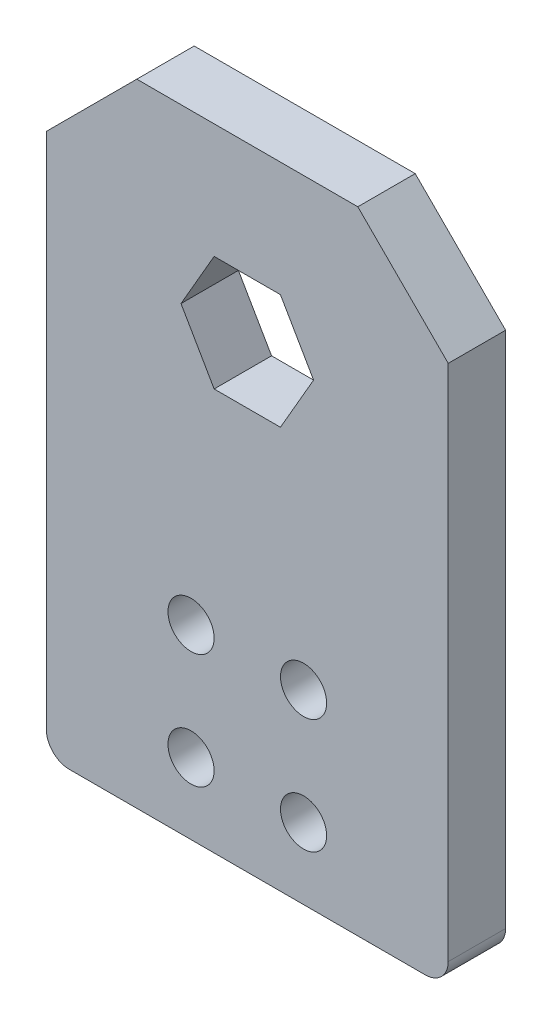
ISO-10303-21;
HEADER;
FILE_DESCRIPTION(('STEP AP214'),'2;1');
FILE_NAME('part.step','',(''),(''),'','','');
FILE_SCHEMA(('AUTOMOTIVE_DESIGN { 1 0 10303 214 1 1 1 1 }'));
ENDSEC;
DATA;
#1=APPLICATION_CONTEXT('core data for automotive mechanical design processes');
#2=APPLICATION_PROTOCOL_DEFINITION('international standard','automotive_design',2000,#1);
#3=PRODUCT_CONTEXT('',#1,'mechanical');
#4=PRODUCT('Part','Part','',(#3));
#5=PRODUCT_RELATED_PRODUCT_CATEGORY('part','',(#4));
#6=PRODUCT_DEFINITION_FORMATION('','',#4);
#7=PRODUCT_DEFINITION_CONTEXT('part definition',#1,'design');
#8=PRODUCT_DEFINITION('design','',#6,#7);
#9=PRODUCT_DEFINITION_SHAPE('','',#8);
#10=(LENGTH_UNIT() NAMED_UNIT(*) SI_UNIT(.MILLI.,.METRE.));
#11=(NAMED_UNIT(*) PLANE_ANGLE_UNIT() SI_UNIT($,.RADIAN.));
#12=(NAMED_UNIT(*) SI_UNIT($,.STERADIAN.) SOLID_ANGLE_UNIT());
#13=UNCERTAINTY_MEASURE_WITH_UNIT(LENGTH_MEASURE(1.E-05),#10,'distance_accuracy_value','');
#14=(GEOMETRIC_REPRESENTATION_CONTEXT(3) GLOBAL_UNCERTAINTY_ASSIGNED_CONTEXT((#13)) GLOBAL_UNIT_ASSIGNED_CONTEXT((#10,
#11,#12)) REPRESENTATION_CONTEXT('',''));
#15=CARTESIAN_POINT('',(0.,0.,0.));
#16=DIRECTION('',(0.,0.,1.));
#17=DIRECTION('',(1.,0.,0.));
#18=AXIS2_PLACEMENT_3D('',#15,#16,#17);
#19=CARTESIAN_POINT('',(22.225,-34.925,3.175));
#20=DIRECTION('',(-1.,0.,0.));
#21=DIRECTION('',(0.,0.,1.));
#22=AXIS2_PLACEMENT_3D('',#19,#20,#21);
#23=PLANE('',#22);
#24=DIRECTION('',(0.,1.,0.));
#25=VECTOR('',#24,1.);
#26=CARTESIAN_POINT('',(22.225,-34.925,3.175));
#27=LINE('',#26,#25);
#28=CARTESIAN_POINT('',(22.225,-32.385,3.175));
#29=VERTEX_POINT('',#28);
#30=CARTESIAN_POINT('',(22.225,24.925,3.175));
#31=VERTEX_POINT('',#30);
#32=EDGE_CURVE('E216',#29,#31,#27,.T.);
#33=ORIENTED_EDGE('',*,*,#32,.F.);
#34=DIRECTION('',(0.,0.,-1.));
#35=VECTOR('',#34,1.);
#36=CARTESIAN_POINT('',(22.225,-32.385,3.175));
#37=LINE('',#36,#35);
#38=CARTESIAN_POINT('',(22.225,-32.385,-3.175));
#39=VERTEX_POINT('',#38);
#40=EDGE_CURVE('E253',#29,#39,#37,.T.);
#41=ORIENTED_EDGE('',*,*,#40,.T.);
#42=DIRECTION('',(0.,1.,0.));
#43=VECTOR('',#42,1.);
#44=CARTESIAN_POINT('',(22.225,-34.925,-3.175));
#45=LINE('',#44,#43);
#46=CARTESIAN_POINT('',(22.225,24.925,-3.175));
#47=VERTEX_POINT('',#46);
#48=EDGE_CURVE('E205',#39,#47,#45,.T.);
#49=ORIENTED_EDGE('',*,*,#48,.T.);
#50=DIRECTION('',(0.,0.,1.));
#51=VECTOR('',#50,1.);
#52=CARTESIAN_POINT('',(22.225,24.925,3.175));
#53=LINE('',#52,#51);
#54=EDGE_CURVE('E243',#47,#31,#53,.T.);
#55=ORIENTED_EDGE('',*,*,#54,.T.);
#56=EDGE_LOOP('',(#33,#41,#49,#55));
#57=FACE_BOUND('',#56,.T.);
#58=ADVANCED_FACE('F37',(#57),#23,.F.);
#59=CARTESIAN_POINT('',(-22.225,34.925,3.175));
#60=DIRECTION('',(0.,-1.,0.));
#61=DIRECTION('',(0.,0.,-1.));
#62=AXIS2_PLACEMENT_3D('',#59,#60,#61);
#63=PLANE('',#62);
#64=DIRECTION('',(-1.,0.,0.));
#65=VECTOR('',#64,1.);
#66=CARTESIAN_POINT('',(-22.225,34.925,3.175));
#67=LINE('',#66,#65);
#68=CARTESIAN_POINT('',(12.225,34.925,3.175));
#69=VERTEX_POINT('',#68);
#70=CARTESIAN_POINT('',(-12.225,34.925,3.175));
#71=VERTEX_POINT('',#70);
#72=EDGE_CURVE('E218',#69,#71,#67,.T.);
#73=ORIENTED_EDGE('',*,*,#72,.F.);
#74=DIRECTION('',(0.,0.,-1.));
#75=VECTOR('',#74,1.);
#76=CARTESIAN_POINT('',(12.225,34.925,3.175));
#77=LINE('',#76,#75);
#78=CARTESIAN_POINT('',(12.225,34.925,-3.175));
#79=VERTEX_POINT('',#78);
#80=EDGE_CURVE('E235',#69,#79,#77,.T.);
#81=ORIENTED_EDGE('',*,*,#80,.T.);
#82=DIRECTION('',(-1.,0.,0.));
#83=VECTOR('',#82,1.);
#84=CARTESIAN_POINT('',(-22.225,34.925,-3.175));
#85=LINE('',#84,#83);
#86=CARTESIAN_POINT('',(-12.225,34.925,-3.175));
#87=VERTEX_POINT('',#86);
#88=EDGE_CURVE('E228',#79,#87,#85,.T.);
#89=ORIENTED_EDGE('',*,*,#88,.T.);
#90=DIRECTION('',(0.,0.,1.));
#91=VECTOR('',#90,1.);
#92=CARTESIAN_POINT('',(-12.225,34.925,3.175));
#93=LINE('',#92,#91);
#94=EDGE_CURVE('E226',#87,#71,#93,.T.);
#95=ORIENTED_EDGE('',*,*,#94,.T.);
#96=EDGE_LOOP('',(#73,#81,#89,#95));
#97=FACE_BOUND('',#96,.T.);
#98=ADVANCED_FACE('F293',(#97),#63,.F.);
#99=CARTESIAN_POINT('',(-22.225,-34.925,3.175));
#100=DIRECTION('',(1.,0.,0.));
#101=DIRECTION('',(0.,0.,-1.));
#102=AXIS2_PLACEMENT_3D('',#99,#100,#101);
#103=PLANE('',#102);
#104=DIRECTION('',(0.,-1.,0.));
#105=VECTOR('',#104,1.);
#106=CARTESIAN_POINT('',(-22.225,-34.925,-3.175));
#107=LINE('',#106,#105);
#108=CARTESIAN_POINT('',(-22.225,24.925,-3.175));
#109=VERTEX_POINT('',#108);
#110=CARTESIAN_POINT('',(-22.225,-32.385,-3.175));
#111=VERTEX_POINT('',#110);
#112=EDGE_CURVE('E231',#109,#111,#107,.T.);
#113=ORIENTED_EDGE('',*,*,#112,.T.);
#114=DIRECTION('',(0.,0.,-1.));
#115=VECTOR('',#114,1.);
#116=CARTESIAN_POINT('',(-22.225,-32.385,3.175));
#117=LINE('',#116,#115);
#118=CARTESIAN_POINT('',(-22.225,-32.385,3.175));
#119=VERTEX_POINT('',#118);
#120=EDGE_CURVE('E11',#111,#119,#117,.F.);
#121=ORIENTED_EDGE('',*,*,#120,.T.);
#122=DIRECTION('',(0.,-1.,0.));
#123=VECTOR('',#122,1.);
#124=CARTESIAN_POINT('',(-22.225,-34.925,3.175));
#125=LINE('',#124,#123);
#126=CARTESIAN_POINT('',(-22.225,24.925,3.175));
#127=VERTEX_POINT('',#126);
#128=EDGE_CURVE('E222',#127,#119,#125,.T.);
#129=ORIENTED_EDGE('',*,*,#128,.F.);
#130=DIRECTION('',(0.,0.,-1.));
#131=VECTOR('',#130,1.);
#132=CARTESIAN_POINT('',(-22.225,24.925,3.175));
#133=LINE('',#132,#131);
#134=EDGE_CURVE('E250',#127,#109,#133,.T.);
#135=ORIENTED_EDGE('',*,*,#134,.T.);
#136=EDGE_LOOP('',(#113,#121,#129,#135));
#137=FACE_BOUND('',#136,.T.);
#138=ADVANCED_FACE('F284',(#137),#103,.F.);
#139=CARTESIAN_POINT('',(-22.225,-34.925,3.175));
#140=DIRECTION('',(0.,1.,0.));
#141=DIRECTION('',(0.,0.,1.));
#142=AXIS2_PLACEMENT_3D('',#139,#140,#141);
#143=PLANE('',#142);
#144=CARTESIAN_POINT('',(-15.875,-34.925,0.));
#145=DIRECTION('',(0.,-1.,0.));
#146=DIRECTION('',(0.,0.,-1.));
#147=AXIS2_PLACEMENT_3D('',#144,#145,#146);
#148=CIRCLE('',#147,1.89864999999999);
#149=CARTESIAN_POINT('',(-15.875,-34.925,-1.89865));
#150=VERTEX_POINT('',#149);
#151=EDGE_CURVE('E155',#150,#150,#148,.T.);
#152=ORIENTED_EDGE('',*,*,#151,.F.);
#153=EDGE_LOOP('',(#152));
#154=FACE_BOUND('',#153,.T.);
#155=CARTESIAN_POINT('',(15.875,-34.925,0.));
#156=DIRECTION('',(0.,-1.,0.));
#157=DIRECTION('',(0.,0.,-1.));
#158=AXIS2_PLACEMENT_3D('',#155,#156,#157);
#159=CIRCLE('',#158,1.89864999999999);
#160=CARTESIAN_POINT('',(15.875,-34.925,-1.89864999999999));
#161=VERTEX_POINT('',#160);
#162=EDGE_CURVE('E154',#161,#161,#159,.T.);
#163=ORIENTED_EDGE('',*,*,#162,.F.);
#164=EDGE_LOOP('',(#163));
#165=FACE_BOUND('',#164,.T.);
#166=DIRECTION('',(1.,0.,0.));
#167=VECTOR('',#166,1.);
#168=CARTESIAN_POINT('',(-22.225,-34.925,-3.175));
#169=LINE('',#168,#167);
#170=CARTESIAN_POINT('',(-19.685,-34.925,-3.175));
#171=VERTEX_POINT('',#170);
#172=CARTESIAN_POINT('',(19.685,-34.925,-3.175));
#173=VERTEX_POINT('',#172);
#174=EDGE_CURVE('E219',#171,#173,#169,.T.);
#175=ORIENTED_EDGE('',*,*,#174,.T.);
#176=DIRECTION('',(0.,0.,-1.));
#177=VECTOR('',#176,1.);
#178=CARTESIAN_POINT('',(19.685,-34.925,3.175));
#179=LINE('',#178,#177);
#180=CARTESIAN_POINT('',(19.685,-34.925,3.175));
#181=VERTEX_POINT('',#180);
#182=EDGE_CURVE('E58',#173,#181,#179,.F.);
#183=ORIENTED_EDGE('',*,*,#182,.T.);
#184=DIRECTION('',(1.,0.,0.));
#185=VECTOR('',#184,1.);
#186=CARTESIAN_POINT('',(-22.225,-34.925,3.175));
#187=LINE('',#186,#185);
#188=CARTESIAN_POINT('',(-19.685,-34.925,3.175));
#189=VERTEX_POINT('',#188);
#190=EDGE_CURVE('E224',#189,#181,#187,.T.);
#191=ORIENTED_EDGE('',*,*,#190,.F.);
#192=DIRECTION('',(0.,0.,-1.));
#193=VECTOR('',#192,1.);
#194=CARTESIAN_POINT('',(-19.685,-34.925,3.175));
#195=LINE('',#194,#193);
#196=EDGE_CURVE('E260',#189,#171,#195,.T.);
#197=ORIENTED_EDGE('',*,*,#196,.T.);
#198=EDGE_LOOP('',(#175,#183,#191,#197));
#199=FACE_BOUND('',#198,.T.);
#200=ADVANCED_FACE('F279',(#154,#165,#199),#143,.F.);
#201=CARTESIAN_POINT('',(0.,0.,3.175));
#202=DIRECTION('',(0.,0.,-1.));
#203=DIRECTION('',(-1.,0.,0.));
#204=AXIS2_PLACEMENT_3D('',#201,#202,#203);
#205=PLANE('',#204);
#206=CARTESIAN_POINT('',(-6.22299999999999,-14.351,3.175));
#207=DIRECTION('',(0.,0.,1.));
#208=DIRECTION('',(1.,0.,0.));
#209=AXIS2_PLACEMENT_3D('',#206,#207,#208);
#210=CIRCLE('',#209,2.55269999999999);
#211=CARTESIAN_POINT('',(-3.6703,-14.351,3.175));
#212=VERTEX_POINT('',#211);
#213=EDGE_CURVE('E379',#212,#212,#210,.T.);
#214=ORIENTED_EDGE('',*,*,#213,.F.);
#215=EDGE_LOOP('',(#214));
#216=FACE_BOUND('',#215,.T.);
#217=CARTESIAN_POINT('',(6.22300000000001,-14.351,3.175));
#218=DIRECTION('',(0.,0.,1.));
#219=DIRECTION('',(1.,0.,0.));
#220=AXIS2_PLACEMENT_3D('',#217,#218,#219);
#221=CIRCLE('',#220,2.55269999999999);
#222=CARTESIAN_POINT('',(8.7757,-14.351,3.175));
#223=VERTEX_POINT('',#222);
#224=EDGE_CURVE('E381',#223,#223,#221,.T.);
#225=ORIENTED_EDGE('',*,*,#224,.F.);
#226=EDGE_LOOP('',(#225));
#227=FACE_BOUND('',#226,.T.);
#228=CARTESIAN_POINT('',(6.22300000000001,-27.051,3.175));
#229=DIRECTION('',(0.,0.,1.));
#230=DIRECTION('',(1.,0.,0.));
#231=AXIS2_PLACEMENT_3D('',#228,#229,#230);
#232=CIRCLE('',#231,2.55269999999999);
#233=CARTESIAN_POINT('',(8.7757,-27.051,3.175));
#234=VERTEX_POINT('',#233);
#235=EDGE_CURVE('E389',#234,#234,#232,.T.);
#236=ORIENTED_EDGE('',*,*,#235,.F.);
#237=EDGE_LOOP('',(#236));
#238=FACE_BOUND('',#237,.T.);
#239=CARTESIAN_POINT('',(-6.22299999999999,-27.051,3.175));
#240=DIRECTION('',(0.,0.,1.));
#241=DIRECTION('',(1.,0.,0.));
#242=AXIS2_PLACEMENT_3D('',#239,#240,#241);
#243=CIRCLE('',#242,2.55269999999999);
#244=CARTESIAN_POINT('',(-3.6703,-27.051,3.175));
#245=VERTEX_POINT('',#244);
#246=EDGE_CURVE('E395',#245,#245,#243,.T.);
#247=ORIENTED_EDGE('',*,*,#246,.F.);
#248=EDGE_LOOP('',(#247));
#249=FACE_BOUND('',#248,.T.);
#250=DIRECTION('',(-0.5,0.866025403784438,0.));
#251=VECTOR('',#250,1.);
#252=CARTESIAN_POINT('',(7.33234841870825,15.875,3.175));
#253=LINE('',#252,#251);
#254=CARTESIAN_POINT('',(7.33234841870825,15.875,3.175));
#255=VERTEX_POINT('',#254);
#256=CARTESIAN_POINT('',(3.66617420935412,22.225,3.175));
#257=VERTEX_POINT('',#256);
#258=EDGE_CURVE('E189',#255,#257,#253,.T.);
#259=ORIENTED_EDGE('',*,*,#258,.F.);
#260=DIRECTION('',(0.5,0.866025403784439,0.));
#261=VECTOR('',#260,1.);
#262=CARTESIAN_POINT('',(3.66617420935412,9.52499999999999,3.175));
#263=LINE('',#262,#261);
#264=CARTESIAN_POINT('',(3.66617420935412,9.52499999999999,3.175));
#265=VERTEX_POINT('',#264);
#266=EDGE_CURVE('E167',#265,#255,#263,.T.);
#267=ORIENTED_EDGE('',*,*,#266,.F.);
#268=DIRECTION('',(1.,0.,0.));
#269=VECTOR('',#268,1.);
#270=CARTESIAN_POINT('',(-3.66617420935412,9.52499999999999,3.175));
#271=LINE('',#270,#269);
#272=CARTESIAN_POINT('',(-3.66617420935412,9.52499999999999,3.175));
#273=VERTEX_POINT('',#272);
#274=EDGE_CURVE('E172',#273,#265,#271,.T.);
#275=ORIENTED_EDGE('',*,*,#274,.F.);
#276=DIRECTION('',(0.5,-0.866025403784439,0.));
#277=VECTOR('',#276,1.);
#278=CARTESIAN_POINT('',(-7.33234841870825,15.875,3.175));
#279=LINE('',#278,#277);
#280=CARTESIAN_POINT('',(-7.33234841870825,15.875,3.175));
#281=VERTEX_POINT('',#280);
#282=EDGE_CURVE('E198',#281,#273,#279,.T.);
#283=ORIENTED_EDGE('',*,*,#282,.F.);
#284=DIRECTION('',(-0.5,-0.866025403784439,0.));
#285=VECTOR('',#284,1.);
#286=CARTESIAN_POINT('',(-3.66617420935412,22.225,3.175));
#287=LINE('',#286,#285);
#288=CARTESIAN_POINT('',(-3.66617420935412,22.225,3.175));
#289=VERTEX_POINT('',#288);
#290=EDGE_CURVE('E195',#289,#281,#287,.T.);
#291=ORIENTED_EDGE('',*,*,#290,.F.);
#292=DIRECTION('',(-1.,0.,0.));
#293=VECTOR('',#292,1.);
#294=CARTESIAN_POINT('',(3.66617420935412,22.225,3.175));
#295=LINE('',#294,#293);
#296=EDGE_CURVE('E192',#257,#289,#295,.T.);
#297=ORIENTED_EDGE('',*,*,#296,.F.);
#298=EDGE_LOOP('',(#259,#267,#275,#283,#291,#297));
#299=FACE_BOUND('',#298,.T.);
#300=ORIENTED_EDGE('',*,*,#190,.T.);
#301=CARTESIAN_POINT('',(19.685,-32.385,3.175));
#302=DIRECTION('',(0.,0.,-1.));
#303=DIRECTION('',(-1.,0.,0.));
#304=AXIS2_PLACEMENT_3D('',#301,#302,#303);
#305=CIRCLE('',#304,2.54);
#306=EDGE_CURVE('E45',#181,#29,#305,.F.);
#307=ORIENTED_EDGE('',*,*,#306,.T.);
#308=ORIENTED_EDGE('',*,*,#32,.T.);
#309=DIRECTION('',(0.707106781186546,-0.707106781186549,0.));
#310=VECTOR('',#309,1.);
#311=CARTESIAN_POINT('',(12.225,34.925,3.175));
#312=LINE('',#311,#310);
#313=EDGE_CURVE('E248',#31,#69,#312,.F.);
#314=ORIENTED_EDGE('',*,*,#313,.T.);
#315=ORIENTED_EDGE('',*,*,#72,.T.);
#316=DIRECTION('',(0.707106781186549,0.707106781186546,0.));
#317=VECTOR('',#316,1.);
#318=CARTESIAN_POINT('',(-22.225,24.925,3.175));
#319=LINE('',#318,#317);
#320=EDGE_CURVE('E246',#71,#127,#319,.F.);
#321=ORIENTED_EDGE('',*,*,#320,.T.);
#322=ORIENTED_EDGE('',*,*,#128,.T.);
#323=CARTESIAN_POINT('',(-19.685,-32.385,3.175));
#324=DIRECTION('',(0.,0.,-1.));
#325=DIRECTION('',(-1.,0.,0.));
#326=AXIS2_PLACEMENT_3D('',#323,#324,#325);
#327=CIRCLE('',#326,2.54);
#328=EDGE_CURVE('E264',#119,#189,#327,.F.);
#329=ORIENTED_EDGE('',*,*,#328,.T.);
#330=EDGE_LOOP('',(#300,#307,#308,#314,#315,#321,#322,#329));
#331=FACE_BOUND('',#330,.T.);
#332=ADVANCED_FACE('F268',(#216,#227,#238,#249,#299,#331),#205,.F.);
#333=CARTESIAN_POINT('',(0.,0.,-3.175));
#334=DIRECTION('',(0.,0.,-1.));
#335=DIRECTION('',(-1.,0.,0.));
#336=AXIS2_PLACEMENT_3D('',#333,#334,#335);
#337=PLANE('',#336);
#338=CARTESIAN_POINT('',(-6.22299999999999,-14.351,-3.175));
#339=DIRECTION('',(0.,0.,-1.));
#340=DIRECTION('',(-1.,0.,0.));
#341=AXIS2_PLACEMENT_3D('',#338,#339,#340);
#342=CIRCLE('',#341,2.55269999999999);
#343=CARTESIAN_POINT('',(-8.77569999999998,-14.351,-3.175));
#344=VERTEX_POINT('',#343);
#345=EDGE_CURVE('E376',#344,#344,#342,.T.);
#346=ORIENTED_EDGE('',*,*,#345,.F.);
#347=EDGE_LOOP('',(#346));
#348=FACE_BOUND('',#347,.T.);
#349=CARTESIAN_POINT('',(6.22300000000001,-14.351,-3.175));
#350=DIRECTION('',(0.,0.,-1.));
#351=DIRECTION('',(-1.,0.,0.));
#352=AXIS2_PLACEMENT_3D('',#349,#350,#351);
#353=CIRCLE('',#352,2.55269999999999);
#354=CARTESIAN_POINT('',(3.67030000000002,-14.351,-3.175));
#355=VERTEX_POINT('',#354);
#356=EDGE_CURVE('E386',#355,#355,#353,.T.);
#357=ORIENTED_EDGE('',*,*,#356,.F.);
#358=EDGE_LOOP('',(#357));
#359=FACE_BOUND('',#358,.T.);
#360=CARTESIAN_POINT('',(6.22300000000001,-27.051,-3.175));
#361=DIRECTION('',(0.,0.,-1.));
#362=DIRECTION('',(-1.,0.,0.));
#363=AXIS2_PLACEMENT_3D('',#360,#361,#362);
#364=CIRCLE('',#363,2.55269999999999);
#365=CARTESIAN_POINT('',(3.67030000000002,-27.051,-3.175));
#366=VERTEX_POINT('',#365);
#367=EDGE_CURVE('E392',#366,#366,#364,.T.);
#368=ORIENTED_EDGE('',*,*,#367,.F.);
#369=EDGE_LOOP('',(#368));
#370=FACE_BOUND('',#369,.T.);
#371=CARTESIAN_POINT('',(-6.22299999999999,-27.051,-3.175));
#372=DIRECTION('',(0.,0.,-1.));
#373=DIRECTION('',(-1.,0.,0.));
#374=AXIS2_PLACEMENT_3D('',#371,#372,#373);
#375=CIRCLE('',#374,2.55269999999999);
#376=CARTESIAN_POINT('',(-8.77569999999998,-27.051,-3.175));
#377=VERTEX_POINT('',#376);
#378=EDGE_CURVE('E161',#377,#377,#375,.T.);
#379=ORIENTED_EDGE('',*,*,#378,.F.);
#380=EDGE_LOOP('',(#379));
#381=FACE_BOUND('',#380,.T.);
#382=DIRECTION('',(0.5,0.866025403784439,0.));
#383=VECTOR('',#382,1.);
#384=CARTESIAN_POINT('',(3.66617420935412,9.52499999999999,-3.175));
#385=LINE('',#384,#383);
#386=CARTESIAN_POINT('',(3.66617420935412,9.52499999999999,-3.175));
#387=VERTEX_POINT('',#386);
#388=CARTESIAN_POINT('',(7.33234841870825,15.875,-3.175));
#389=VERTEX_POINT('',#388);
#390=EDGE_CURVE('E168',#387,#389,#385,.T.);
#391=ORIENTED_EDGE('',*,*,#390,.T.);
#392=DIRECTION('',(-0.5,0.866025403784438,0.));
#393=VECTOR('',#392,1.);
#394=CARTESIAN_POINT('',(7.33234841870825,15.875,-3.175));
#395=LINE('',#394,#393);
#396=CARTESIAN_POINT('',(3.66617420935412,22.225,-3.175));
#397=VERTEX_POINT('',#396);
#398=EDGE_CURVE('E171',#389,#397,#395,.T.);
#399=ORIENTED_EDGE('',*,*,#398,.T.);
#400=DIRECTION('',(-1.,0.,0.));
#401=VECTOR('',#400,1.);
#402=CARTESIAN_POINT('',(3.66617420935412,22.225,-3.175));
#403=LINE('',#402,#401);
#404=CARTESIAN_POINT('',(-3.66617420935412,22.225,-3.175));
#405=VERTEX_POINT('',#404);
#406=EDGE_CURVE('E175',#397,#405,#403,.T.);
#407=ORIENTED_EDGE('',*,*,#406,.T.);
#408=DIRECTION('',(-0.5,-0.866025403784439,0.));
#409=VECTOR('',#408,1.);
#410=CARTESIAN_POINT('',(-3.66617420935412,22.225,-3.175));
#411=LINE('',#410,#409);
#412=CARTESIAN_POINT('',(-7.33234841870825,15.875,-3.175));
#413=VERTEX_POINT('',#412);
#414=EDGE_CURVE('E178',#405,#413,#411,.T.);
#415=ORIENTED_EDGE('',*,*,#414,.T.);
#416=DIRECTION('',(0.5,-0.866025403784439,0.));
#417=VECTOR('',#416,1.);
#418=CARTESIAN_POINT('',(-7.33234841870825,15.875,-3.175));
#419=LINE('',#418,#417);
#420=CARTESIAN_POINT('',(-3.66617420935412,9.52499999999999,-3.175));
#421=VERTEX_POINT('',#420);
#422=EDGE_CURVE('E181',#413,#421,#419,.T.);
#423=ORIENTED_EDGE('',*,*,#422,.T.);
#424=DIRECTION('',(1.,0.,0.));
#425=VECTOR('',#424,1.);
#426=CARTESIAN_POINT('',(-3.66617420935412,9.52499999999999,-3.175));
#427=LINE('',#426,#425);
#428=EDGE_CURVE('E184',#421,#387,#427,.T.);
#429=ORIENTED_EDGE('',*,*,#428,.T.);
#430=EDGE_LOOP('',(#391,#399,#407,#415,#423,#429));
#431=FACE_BOUND('',#430,.T.);
#432=ORIENTED_EDGE('',*,*,#48,.F.);
#433=CARTESIAN_POINT('',(19.685,-32.385,-3.175));
#434=DIRECTION('',(0.,0.,-1.));
#435=DIRECTION('',(-1.,0.,0.));
#436=AXIS2_PLACEMENT_3D('',#433,#434,#435);
#437=CIRCLE('',#436,2.54);
#438=EDGE_CURVE('E258',#39,#173,#437,.T.);
#439=ORIENTED_EDGE('',*,*,#438,.T.);
#440=ORIENTED_EDGE('',*,*,#174,.F.);
#441=CARTESIAN_POINT('',(-19.685,-32.385,-3.175));
#442=DIRECTION('',(0.,0.,-1.));
#443=DIRECTION('',(-1.,0.,0.));
#444=AXIS2_PLACEMENT_3D('',#441,#442,#443);
#445=CIRCLE('',#444,2.54);
#446=EDGE_CURVE('E256',#171,#111,#445,.T.);
#447=ORIENTED_EDGE('',*,*,#446,.T.);
#448=ORIENTED_EDGE('',*,*,#112,.F.);
#449=DIRECTION('',(-0.707106781186549,-0.707106781186546,0.));
#450=VECTOR('',#449,1.);
#451=CARTESIAN_POINT('',(-23.575,23.575,-3.175));
#452=LINE('',#451,#450);
#453=EDGE_CURVE('E238',#109,#87,#452,.F.);
#454=ORIENTED_EDGE('',*,*,#453,.T.);
#455=ORIENTED_EDGE('',*,*,#88,.F.);
#456=DIRECTION('',(-0.707106781186546,0.707106781186549,0.));
#457=VECTOR('',#456,1.);
#458=CARTESIAN_POINT('',(23.575,23.5749999999999,-3.175));
#459=LINE('',#458,#457);
#460=EDGE_CURVE('E240',#79,#47,#459,.F.);
#461=ORIENTED_EDGE('',*,*,#460,.T.);
#462=EDGE_LOOP('',(#432,#439,#440,#447,#448,#454,#455,#461));
#463=FACE_BOUND('',#462,.T.);
#464=ADVANCED_FACE('F278',(#348,#359,#370,#381,#431,#463),#337,.T.);
#465=CARTESIAN_POINT('',(12.225,34.925,3.175));
#466=DIRECTION('',(-0.707106781186549,-0.707106781186546,0.));
#467=DIRECTION('',(0.,0.,-1.));
#468=AXIS2_PLACEMENT_3D('',#465,#466,#467);
#469=PLANE('',#468);
#470=ORIENTED_EDGE('',*,*,#313,.F.);
#471=ORIENTED_EDGE('',*,*,#54,.F.);
#472=ORIENTED_EDGE('',*,*,#460,.F.);
#473=ORIENTED_EDGE('',*,*,#80,.F.);
#474=EDGE_LOOP('',(#470,#471,#472,#473));
#475=FACE_BOUND('',#474,.T.);
#476=ADVANCED_FACE('F296',(#475),#469,.F.);
#477=CARTESIAN_POINT('',(-22.225,24.925,3.175));
#478=DIRECTION('',(0.707106781186546,-0.707106781186549,0.));
#479=DIRECTION('',(0.,0.,-1.));
#480=AXIS2_PLACEMENT_3D('',#477,#478,#479);
#481=PLANE('',#480);
#482=ORIENTED_EDGE('',*,*,#320,.F.);
#483=ORIENTED_EDGE('',*,*,#94,.F.);
#484=ORIENTED_EDGE('',*,*,#453,.F.);
#485=ORIENTED_EDGE('',*,*,#134,.F.);
#486=EDGE_LOOP('',(#482,#483,#484,#485));
#487=FACE_BOUND('',#486,.T.);
#488=ADVANCED_FACE('F288',(#487),#481,.F.);
#489=CARTESIAN_POINT('',(3.66617420935412,9.52499999999999,-3.175));
#490=DIRECTION('',(0.866025403784439,-0.5,0.));
#491=DIRECTION('',(0.5,0.866025403784439,0.));
#492=AXIS2_PLACEMENT_3D('',#489,#490,#491);
#493=PLANE('',#492);
#494=ORIENTED_EDGE('',*,*,#266,.T.);
#495=DIRECTION('',(0.,0.,1.));
#496=VECTOR('',#495,1.);
#497=CARTESIAN_POINT('',(7.33234841870825,15.875,-3.175));
#498=LINE('',#497,#496);
#499=EDGE_CURVE('E187',#389,#255,#498,.T.);
#500=ORIENTED_EDGE('',*,*,#499,.F.);
#501=ORIENTED_EDGE('',*,*,#390,.F.);
#502=DIRECTION('',(0.,0.,1.));
#503=VECTOR('',#502,1.);
#504=CARTESIAN_POINT('',(3.66617420935412,9.52499999999999,-3.175));
#505=LINE('',#504,#503);
#506=EDGE_CURVE('E203',#387,#265,#505,.T.);
#507=ORIENTED_EDGE('',*,*,#506,.T.);
#508=EDGE_LOOP('',(#494,#500,#501,#507));
#509=FACE_BOUND('',#508,.T.);
#510=ADVANCED_FACE('F303',(#509),#493,.F.);
#511=CARTESIAN_POINT('',(-3.66617420935412,9.52499999999999,-3.175));
#512=DIRECTION('',(0.,-1.,0.));
#513=DIRECTION('',(0.,0.,-1.));
#514=AXIS2_PLACEMENT_3D('',#511,#512,#513);
#515=PLANE('',#514);
#516=ORIENTED_EDGE('',*,*,#274,.T.);
#517=ORIENTED_EDGE('',*,*,#506,.F.);
#518=ORIENTED_EDGE('',*,*,#428,.F.);
#519=DIRECTION('',(0.,0.,1.));
#520=VECTOR('',#519,1.);
#521=CARTESIAN_POINT('',(-3.66617420935412,9.52499999999999,-3.175));
#522=LINE('',#521,#520);
#523=EDGE_CURVE('E206',#421,#273,#522,.T.);
#524=ORIENTED_EDGE('',*,*,#523,.T.);
#525=EDGE_LOOP('',(#516,#517,#518,#524));
#526=FACE_BOUND('',#525,.T.);
#527=ADVANCED_FACE('F325',(#526),#515,.F.);
#528=CARTESIAN_POINT('',(-7.33234841870825,15.875,-3.175));
#529=DIRECTION('',(-0.866025403784439,-0.5,0.));
#530=DIRECTION('',(0.5,-0.866025403784439,0.));
#531=AXIS2_PLACEMENT_3D('',#528,#529,#530);
#532=PLANE('',#531);
#533=ORIENTED_EDGE('',*,*,#282,.T.);
#534=ORIENTED_EDGE('',*,*,#523,.F.);
#535=ORIENTED_EDGE('',*,*,#422,.F.);
#536=DIRECTION('',(0.,0.,1.));
#537=VECTOR('',#536,1.);
#538=CARTESIAN_POINT('',(-7.33234841870825,15.875,-3.175));
#539=LINE('',#538,#537);
#540=EDGE_CURVE('E208',#413,#281,#539,.T.);
#541=ORIENTED_EDGE('',*,*,#540,.T.);
#542=EDGE_LOOP('',(#533,#534,#535,#541));
#543=FACE_BOUND('',#542,.T.);
#544=ADVANCED_FACE('F339',(#543),#532,.F.);
#545=CARTESIAN_POINT('',(-3.66617420935412,22.225,-3.175));
#546=DIRECTION('',(-0.866025403784439,0.5,0.));
#547=DIRECTION('',(-0.5,-0.866025403784439,0.));
#548=AXIS2_PLACEMENT_3D('',#545,#546,#547);
#549=PLANE('',#548);
#550=ORIENTED_EDGE('',*,*,#290,.T.);
#551=ORIENTED_EDGE('',*,*,#540,.F.);
#552=ORIENTED_EDGE('',*,*,#414,.F.);
#553=DIRECTION('',(0.,0.,1.));
#554=VECTOR('',#553,1.);
#555=CARTESIAN_POINT('',(-3.66617420935412,22.225,-3.175));
#556=LINE('',#555,#554);
#557=EDGE_CURVE('E210',#405,#289,#556,.T.);
#558=ORIENTED_EDGE('',*,*,#557,.T.);
#559=EDGE_LOOP('',(#550,#551,#552,#558));
#560=FACE_BOUND('',#559,.T.);
#561=ADVANCED_FACE('F335',(#560),#549,.F.);
#562=CARTESIAN_POINT('',(3.66617420935412,22.225,-3.175));
#563=DIRECTION('',(0.,1.,0.));
#564=DIRECTION('',(0.,0.,1.));
#565=AXIS2_PLACEMENT_3D('',#562,#563,#564);
#566=PLANE('',#565);
#567=ORIENTED_EDGE('',*,*,#296,.T.);
#568=ORIENTED_EDGE('',*,*,#557,.F.);
#569=ORIENTED_EDGE('',*,*,#406,.F.);
#570=DIRECTION('',(0.,0.,1.));
#571=VECTOR('',#570,1.);
#572=CARTESIAN_POINT('',(3.66617420935412,22.225,-3.175));
#573=LINE('',#572,#571);
#574=EDGE_CURVE('E212',#397,#257,#573,.T.);
#575=ORIENTED_EDGE('',*,*,#574,.T.);
#576=EDGE_LOOP('',(#567,#568,#569,#575));
#577=FACE_BOUND('',#576,.T.);
#578=ADVANCED_FACE('F331',(#577),#566,.F.);
#579=CARTESIAN_POINT('',(7.33234841870825,15.875,-3.175));
#580=DIRECTION('',(0.866025403784438,0.5,0.));
#581=DIRECTION('',(-0.5,0.866025403784438,0.));
#582=AXIS2_PLACEMENT_3D('',#579,#580,#581);
#583=PLANE('',#582);
#584=ORIENTED_EDGE('',*,*,#258,.T.);
#585=ORIENTED_EDGE('',*,*,#574,.F.);
#586=ORIENTED_EDGE('',*,*,#398,.F.);
#587=ORIENTED_EDGE('',*,*,#499,.T.);
#588=EDGE_LOOP('',(#584,#585,#586,#587));
#589=FACE_BOUND('',#588,.T.);
#590=ADVANCED_FACE('F327',(#589),#583,.F.);
#591=CARTESIAN_POINT('',(15.875,-15.875,0.));
#592=DIRECTION('',(0.,-1.,0.));
#593=DIRECTION('',(0.,0.,-1.));
#594=AXIS2_PLACEMENT_3D('',#591,#592,#593);
#595=CONICAL_SURFACE('',#594,1.89864999999999,1.02974425867665);
#596=CARTESIAN_POINT('',(15.875,-14.7341759856833,0.));
#597=VERTEX_POINT('',#596);
#598=VERTEX_LOOP('',#597);
#599=FACE_BOUND('',#598,.T.);
#600=CARTESIAN_POINT('',(15.875,-15.875,0.));
#601=DIRECTION('',(0.,-1.,0.));
#602=DIRECTION('',(0.,0.,-1.));
#603=AXIS2_PLACEMENT_3D('',#600,#601,#602);
#604=CIRCLE('',#603,1.89864999999999);
#605=CARTESIAN_POINT('',(15.875,-15.875,-1.89864999999999));
#606=VERTEX_POINT('',#605);
#607=EDGE_CURVE('E158',#606,#606,#604,.T.);
#608=ORIENTED_EDGE('',*,*,#607,.T.);
#609=EDGE_LOOP('',(#608));
#610=FACE_BOUND('',#609,.T.);
#611=ADVANCED_FACE('F330',(#599,#610),#595,.F.);
#612=CARTESIAN_POINT('',(15.875,-34.925,0.));
#613=DIRECTION('',(0.,-1.,0.));
#614=DIRECTION('',(0.,0.,-1.));
#615=AXIS2_PLACEMENT_3D('',#612,#613,#614);
#616=CYLINDRICAL_SURFACE('',#615,1.89864999999999);
#617=ORIENTED_EDGE('',*,*,#607,.F.);
#618=EDGE_LOOP('',(#617));
#619=FACE_BOUND('',#618,.T.);
#620=ORIENTED_EDGE('',*,*,#162,.T.);
#621=EDGE_LOOP('',(#620));
#622=FACE_BOUND('',#621,.T.);
#623=ADVANCED_FACE('F148',(#619,#622),#616,.F.);
#624=CARTESIAN_POINT('',(-15.875,-15.875,0.));
#625=DIRECTION('',(0.,-1.,0.));
#626=DIRECTION('',(0.,0.,-1.));
#627=AXIS2_PLACEMENT_3D('',#624,#625,#626);
#628=CONICAL_SURFACE('',#627,1.89864999999999,1.02974425867665);
#629=CARTESIAN_POINT('',(-15.875,-14.7341759856833,0.));
#630=VERTEX_POINT('',#629);
#631=VERTEX_LOOP('',#630);
#632=FACE_BOUND('',#631,.T.);
#633=CARTESIAN_POINT('',(-15.875,-15.875,0.));
#634=DIRECTION('',(0.,-1.,0.));
#635=DIRECTION('',(0.,0.,-1.));
#636=AXIS2_PLACEMENT_3D('',#633,#634,#635);
#637=CIRCLE('',#636,1.89864999999999);
#638=CARTESIAN_POINT('',(-15.875,-15.875,-1.89865));
#639=VERTEX_POINT('',#638);
#640=EDGE_CURVE('E152',#639,#639,#637,.T.);
#641=ORIENTED_EDGE('',*,*,#640,.T.);
#642=EDGE_LOOP('',(#641));
#643=FACE_BOUND('',#642,.T.);
#644=ADVANCED_FACE('F144',(#632,#643),#628,.F.);
#645=CARTESIAN_POINT('',(-15.875,-34.925,0.));
#646=DIRECTION('',(0.,-1.,0.));
#647=DIRECTION('',(0.,0.,-1.));
#648=AXIS2_PLACEMENT_3D('',#645,#646,#647);
#649=CYLINDRICAL_SURFACE('',#648,1.89864999999999);
#650=ORIENTED_EDGE('',*,*,#640,.F.);
#651=EDGE_LOOP('',(#650));
#652=FACE_BOUND('',#651,.T.);
#653=ORIENTED_EDGE('',*,*,#151,.T.);
#654=EDGE_LOOP('',(#653));
#655=FACE_BOUND('',#654,.T.);
#656=ADVANCED_FACE('F147',(#652,#655),#649,.F.);
#657=CARTESIAN_POINT('',(-6.22299999999999,-27.051,3.175));
#658=DIRECTION('',(0.,0.,1.));
#659=DIRECTION('',(1.,0.,0.));
#660=AXIS2_PLACEMENT_3D('',#657,#658,#659);
#661=CYLINDRICAL_SURFACE('',#660,2.55269999999999);
#662=ORIENTED_EDGE('',*,*,#378,.T.);
#663=EDGE_LOOP('',(#662));
#664=FACE_BOUND('',#663,.T.);
#665=ORIENTED_EDGE('',*,*,#246,.T.);
#666=EDGE_LOOP('',(#665));
#667=FACE_BOUND('',#666,.T.);
#668=ADVANCED_FACE('F355',(#664,#667),#661,.F.);
#669=CARTESIAN_POINT('',(6.22300000000001,-27.051,3.175));
#670=DIRECTION('',(0.,0.,1.));
#671=DIRECTION('',(1.,0.,0.));
#672=AXIS2_PLACEMENT_3D('',#669,#670,#671);
#673=CYLINDRICAL_SURFACE('',#672,2.55269999999999);
#674=ORIENTED_EDGE('',*,*,#367,.T.);
#675=EDGE_LOOP('',(#674));
#676=FACE_BOUND('',#675,.T.);
#677=ORIENTED_EDGE('',*,*,#235,.T.);
#678=EDGE_LOOP('',(#677));
#679=FACE_BOUND('',#678,.T.);
#680=ADVANCED_FACE('F358',(#676,#679),#673,.F.);
#681=CARTESIAN_POINT('',(6.22300000000001,-14.351,3.175));
#682=DIRECTION('',(0.,0.,1.));
#683=DIRECTION('',(1.,0.,0.));
#684=AXIS2_PLACEMENT_3D('',#681,#682,#683);
#685=CYLINDRICAL_SURFACE('',#684,2.55269999999999);
#686=ORIENTED_EDGE('',*,*,#356,.T.);
#687=EDGE_LOOP('',(#686));
#688=FACE_BOUND('',#687,.T.);
#689=ORIENTED_EDGE('',*,*,#224,.T.);
#690=EDGE_LOOP('',(#689));
#691=FACE_BOUND('',#690,.T.);
#692=ADVANCED_FACE('F362',(#688,#691),#685,.F.);
#693=CARTESIAN_POINT('',(-6.22299999999999,-14.351,3.175));
#694=DIRECTION('',(0.,0.,1.));
#695=DIRECTION('',(1.,0.,0.));
#696=AXIS2_PLACEMENT_3D('',#693,#694,#695);
#697=CYLINDRICAL_SURFACE('',#696,2.55269999999999);
#698=ORIENTED_EDGE('',*,*,#345,.T.);
#699=EDGE_LOOP('',(#698));
#700=FACE_BOUND('',#699,.T.);
#701=ORIENTED_EDGE('',*,*,#213,.T.);
#702=EDGE_LOOP('',(#701));
#703=FACE_BOUND('',#702,.T.);
#704=ADVANCED_FACE('F366',(#700,#703),#697,.F.);
#705=CARTESIAN_POINT('',(19.685,-32.385,3.175));
#706=DIRECTION('',(0.,0.,-1.));
#707=DIRECTION('',(-1.,0.,0.));
#708=AXIS2_PLACEMENT_3D('',#705,#706,#707);
#709=CYLINDRICAL_SURFACE('',#708,2.54);
#710=ORIENTED_EDGE('',*,*,#306,.F.);
#711=ORIENTED_EDGE('',*,*,#182,.F.);
#712=ORIENTED_EDGE('',*,*,#438,.F.);
#713=ORIENTED_EDGE('',*,*,#40,.F.);
#714=EDGE_LOOP('',(#710,#711,#712,#713));
#715=FACE_BOUND('',#714,.T.);
#716=ADVANCED_FACE('F275',(#715),#709,.T.);
#717=CARTESIAN_POINT('',(-19.685,-32.385,3.175));
#718=DIRECTION('',(0.,0.,-1.));
#719=DIRECTION('',(-1.,0.,0.));
#720=AXIS2_PLACEMENT_3D('',#717,#718,#719);
#721=CYLINDRICAL_SURFACE('',#720,2.54);
#722=ORIENTED_EDGE('',*,*,#328,.F.);
#723=ORIENTED_EDGE('',*,*,#120,.F.);
#724=ORIENTED_EDGE('',*,*,#446,.F.);
#725=ORIENTED_EDGE('',*,*,#196,.F.);
#726=EDGE_LOOP('',(#722,#723,#724,#725));
#727=FACE_BOUND('',#726,.T.);
#728=ADVANCED_FACE('F39',(#727),#721,.T.);
#729=CLOSED_SHELL('',(#58,#98,#138,#200,#332,#464,#476,#488,#510,#527,#544,#561,#578,#590,#611,
#623,#644,#656,#668,#680,#692,#704,#716,#728));
#730=MANIFOLD_SOLID_BREP('B2',#729);
#731=ADVANCED_BREP_SHAPE_REPRESENTATION('',(#18,#730),#14);
#732=SHAPE_DEFINITION_REPRESENTATION(#9,#731);
ENDSEC;
END-ISO-10303-21;
